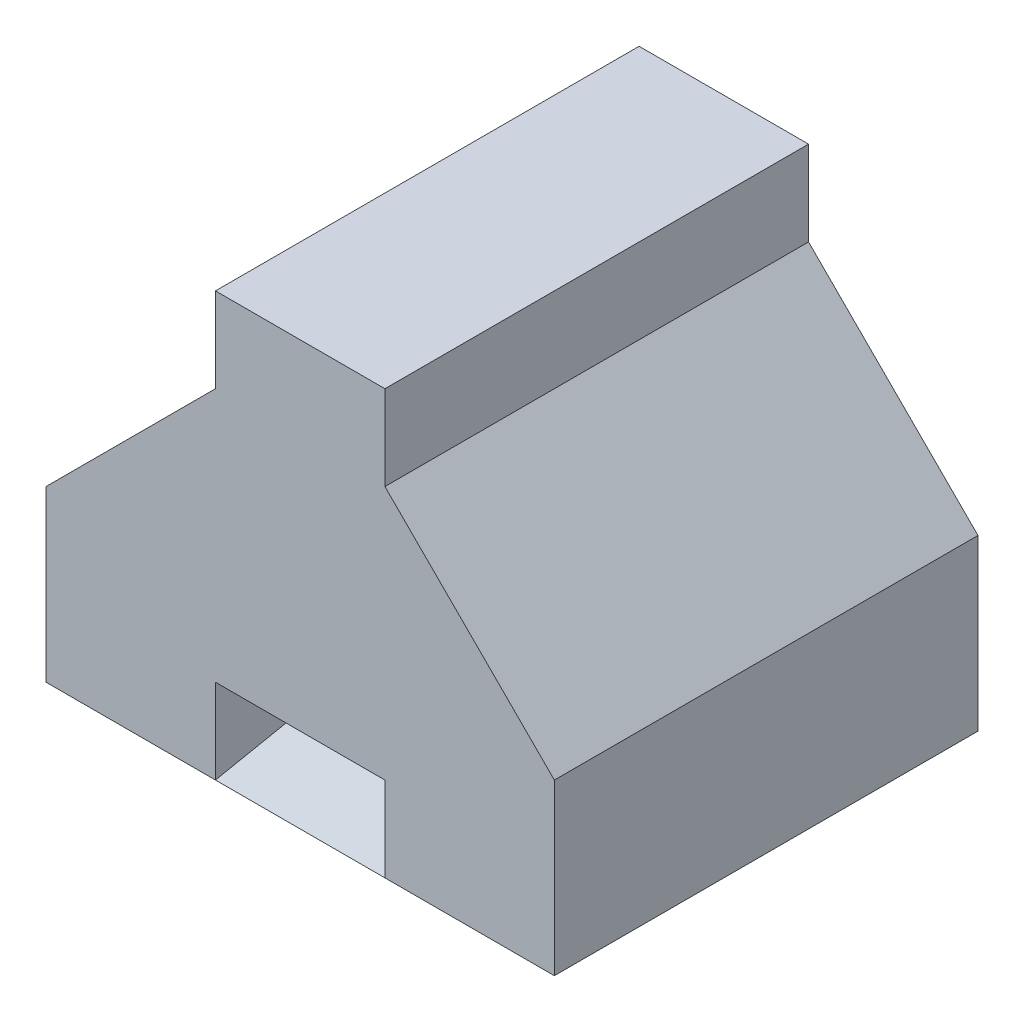
ISO-10303-21;
HEADER;
FILE_DESCRIPTION(('STEP AP214'),'2;1');
FILE_NAME('part.step','',(''),(''),'','','');
FILE_SCHEMA(('AUTOMOTIVE_DESIGN { 1 0 10303 214 1 1 1 1 }'));
ENDSEC;
DATA;
#1=APPLICATION_CONTEXT('core data for automotive mechanical design processes');
#2=APPLICATION_PROTOCOL_DEFINITION('international standard','automotive_design',2000,#1);
#3=PRODUCT_CONTEXT('',#1,'mechanical');
#4=PRODUCT('Part','Part','',(#3));
#5=PRODUCT_RELATED_PRODUCT_CATEGORY('part','',(#4));
#6=PRODUCT_DEFINITION_FORMATION('','',#4);
#7=PRODUCT_DEFINITION_CONTEXT('part definition',#1,'design');
#8=PRODUCT_DEFINITION('design','',#6,#7);
#9=PRODUCT_DEFINITION_SHAPE('','',#8);
#10=(LENGTH_UNIT() NAMED_UNIT(*) SI_UNIT(.MILLI.,.METRE.));
#11=(NAMED_UNIT(*) PLANE_ANGLE_UNIT() SI_UNIT($,.RADIAN.));
#12=(NAMED_UNIT(*) SI_UNIT($,.STERADIAN.) SOLID_ANGLE_UNIT());
#13=UNCERTAINTY_MEASURE_WITH_UNIT(LENGTH_MEASURE(1.E-05),#10,'distance_accuracy_value','');
#14=(GEOMETRIC_REPRESENTATION_CONTEXT(3) GLOBAL_UNCERTAINTY_ASSIGNED_CONTEXT((#13)) GLOBAL_UNIT_ASSIGNED_CONTEXT((#10,
#11,#12)) REPRESENTATION_CONTEXT('',''));
#15=CARTESIAN_POINT('',(0.,0.,0.));
#16=DIRECTION('',(0.,0.,1.));
#17=DIRECTION('',(1.,0.,0.));
#18=AXIS2_PLACEMENT_3D('',#15,#16,#17);
#19=CARTESIAN_POINT('',(-10.,0.,0.));
#20=DIRECTION('',(0.,1.,0.));
#21=DIRECTION('',(0.,0.,1.));
#22=AXIS2_PLACEMENT_3D('',#19,#20,#21);
#23=PLANE('',#22);
#24=DIRECTION('',(0.,0.,-1.));
#25=VECTOR('',#24,1.);
#26=CARTESIAN_POINT('',(-20.,0.,0.));
#27=LINE('',#26,#25);
#28=CARTESIAN_POINT('',(-20.,0.,25.));
#29=VERTEX_POINT('',#28);
#30=CARTESIAN_POINT('',(-20.,0.,0.));
#31=VERTEX_POINT('',#30);
#32=EDGE_CURVE('E90',#29,#31,#27,.T.);
#33=ORIENTED_EDGE('',*,*,#32,.T.);
#34=DIRECTION('',(-1.,0.,0.));
#35=VECTOR('',#34,1.);
#36=CARTESIAN_POINT('',(-10.,0.,0.));
#37=LINE('',#36,#35);
#38=CARTESIAN_POINT('',(-10.,0.,0.));
#39=VERTEX_POINT('',#38);
#40=EDGE_CURVE('E12',#39,#31,#37,.T.);
#41=ORIENTED_EDGE('',*,*,#40,.F.);
#42=DIRECTION('',(0.,0.,-1.));
#43=VECTOR('',#42,1.);
#44=CARTESIAN_POINT('',(-10.,0.,0.));
#45=LINE('',#44,#43);
#46=CARTESIAN_POINT('',(-10.,0.,25.));
#47=VERTEX_POINT('',#46);
#48=EDGE_CURVE('E83',#47,#39,#45,.T.);
#49=ORIENTED_EDGE('',*,*,#48,.F.);
#50=DIRECTION('',(-1.,0.,0.));
#51=VECTOR('',#50,1.);
#52=CARTESIAN_POINT('',(-10.,0.,25.));
#53=LINE('',#52,#51);
#54=EDGE_CURVE('E91',#47,#29,#53,.T.);
#55=ORIENTED_EDGE('',*,*,#54,.T.);
#56=EDGE_LOOP('',(#33,#41,#49,#55));
#57=FACE_BOUND('',#56,.T.);
#58=ADVANCED_FACE('F43',(#57),#23,.F.);
#59=CARTESIAN_POINT('',(-10.,5.,0.));
#60=DIRECTION('',(0.,0.,1.));
#61=DIRECTION('',(1.,0.,0.));
#62=AXIS2_PLACEMENT_3D('',#59,#60,#61);
#63=PLANE('',#62);
#64=DIRECTION('',(0.,1.,0.));
#65=VECTOR('',#64,1.);
#66=CARTESIAN_POINT('',(-20.,5.,0.));
#67=LINE('',#66,#65);
#68=CARTESIAN_POINT('',(-20.,5.,0.));
#69=VERTEX_POINT('',#68);
#70=EDGE_CURVE('E71',#31,#69,#67,.T.);
#71=ORIENTED_EDGE('',*,*,#70,.T.);
#72=DIRECTION('',(-1.,0.,0.));
#73=VECTOR('',#72,1.);
#74=CARTESIAN_POINT('',(-10.,5.,0.));
#75=LINE('',#74,#73);
#76=CARTESIAN_POINT('',(-10.,5.,0.));
#77=VERTEX_POINT('',#76);
#78=EDGE_CURVE('E51',#77,#69,#75,.T.);
#79=ORIENTED_EDGE('',*,*,#78,.F.);
#80=DIRECTION('',(0.,1.,0.));
#81=VECTOR('',#80,1.);
#82=CARTESIAN_POINT('',(-10.,5.,0.));
#83=LINE('',#82,#81);
#84=EDGE_CURVE('E79',#39,#77,#83,.T.);
#85=ORIENTED_EDGE('',*,*,#84,.F.);
#86=ORIENTED_EDGE('',*,*,#40,.T.);
#87=EDGE_LOOP('',(#71,#79,#85,#86));
#88=FACE_BOUND('',#87,.T.);
#89=ADVANCED_FACE('F80',(#88),#63,.F.);
#90=CARTESIAN_POINT('',(-10.,0.,25.));
#91=DIRECTION('',(0.,-0.98058067569092,-0.196116135138184));
#92=DIRECTION('',(0.,0.196116135138184,-0.98058067569092));
#93=AXIS2_PLACEMENT_3D('',#90,#91,#92);
#94=PLANE('',#93);
#95=DIRECTION('',(0.,-0.196116135138184,0.98058067569092));
#96=VECTOR('',#95,1.);
#97=CARTESIAN_POINT('',(-20.,0.,25.));
#98=LINE('',#97,#96);
#99=EDGE_CURVE('E76',#69,#29,#98,.T.);
#100=ORIENTED_EDGE('',*,*,#99,.T.);
#101=ORIENTED_EDGE('',*,*,#54,.F.);
#102=DIRECTION('',(0.,-0.196116135138184,0.98058067569092));
#103=VECTOR('',#102,1.);
#104=CARTESIAN_POINT('',(-10.,0.,25.));
#105=LINE('',#104,#103);
#106=EDGE_CURVE('E59',#77,#47,#105,.T.);
#107=ORIENTED_EDGE('',*,*,#106,.F.);
#108=ORIENTED_EDGE('',*,*,#78,.T.);
#109=EDGE_LOOP('',(#100,#101,#107,#108));
#110=FACE_BOUND('',#109,.T.);
#111=ADVANCED_FACE('F98',(#110),#94,.F.);
#112=CARTESIAN_POINT('',(-10.,0.,0.));
#113=DIRECTION('',(1.,0.,0.));
#114=DIRECTION('',(0.,0.,-1.));
#115=AXIS2_PLACEMENT_3D('',#112,#113,#114);
#116=PLANE('',#115);
#117=ORIENTED_EDGE('',*,*,#48,.T.);
#118=ORIENTED_EDGE('',*,*,#84,.T.);
#119=ORIENTED_EDGE('',*,*,#106,.T.);
#120=EDGE_LOOP('',(#117,#118,#119));
#121=FACE_BOUND('',#120,.T.);
#122=ADVANCED_FACE('F86',(#121),#116,.T.);
#123=CARTESIAN_POINT('',(-20.,0.,0.));
#124=DIRECTION('',(1.,0.,0.));
#125=DIRECTION('',(0.,0.,-1.));
#126=AXIS2_PLACEMENT_3D('',#123,#124,#125);
#127=PLANE('',#126);
#128=ORIENTED_EDGE('',*,*,#32,.F.);
#129=ORIENTED_EDGE('',*,*,#99,.F.);
#130=ORIENTED_EDGE('',*,*,#70,.F.);
#131=EDGE_LOOP('',(#128,#129,#130));
#132=FACE_BOUND('',#131,.T.);
#133=ADVANCED_FACE('F99',(#132),#127,.F.);
#134=CLOSED_SHELL('',(#58,#89,#111,#122,#133));
#135=MANIFOLD_SOLID_BREP('B2',#134);
#136=CARTESIAN_POINT('',(0.,0.,25.));
#137=DIRECTION('',(0.,1.,0.));
#138=DIRECTION('',(-1.,0.,0.));
#139=AXIS2_PLACEMENT_3D('',#136,#137,#138);
#140=PLANE('',#139);
#141=DIRECTION('',(1.,0.,0.));
#142=VECTOR('',#141,1.);
#143=CARTESIAN_POINT('',(0.,0.,0.));
#144=LINE('',#143,#142);
#145=CARTESIAN_POINT('',(-30.,0.,0.));
#146=VERTEX_POINT('',#145);
#147=CARTESIAN_POINT('',(-20.,0.,0.));
#148=VERTEX_POINT('',#147);
#149=EDGE_CURVE('E250',#146,#148,#144,.T.);
#150=ORIENTED_EDGE('',*,*,#149,.T.);
#151=DIRECTION('',(0.,0.,1.));
#152=VECTOR('',#151,1.);
#153=CARTESIAN_POINT('',(-20.,0.,-21.));
#154=LINE('',#153,#152);
#155=CARTESIAN_POINT('',(-20.,0.,25.));
#156=VERTEX_POINT('',#155);
#157=EDGE_CURVE('E338',#148,#156,#154,.T.);
#158=ORIENTED_EDGE('',*,*,#157,.T.);
#159=DIRECTION('',(1.,0.,0.));
#160=VECTOR('',#159,1.);
#161=CARTESIAN_POINT('',(0.,0.,25.));
#162=LINE('',#161,#160);
#163=CARTESIAN_POINT('',(-30.,0.,25.));
#164=VERTEX_POINT('',#163);
#165=EDGE_CURVE('E315',#164,#156,#162,.T.);
#166=ORIENTED_EDGE('',*,*,#165,.F.);
#167=DIRECTION('',(0.,0.,-1.));
#168=VECTOR('',#167,1.);
#169=CARTESIAN_POINT('',(-30.,0.,25.));
#170=LINE('',#169,#168);
#171=EDGE_CURVE('E246',#164,#146,#170,.T.);
#172=ORIENTED_EDGE('',*,*,#171,.T.);
#173=EDGE_LOOP('',(#150,#158,#166,#172));
#174=FACE_BOUND('',#173,.T.);
#175=ADVANCED_FACE('F141',(#174),#140,.F.);
#176=CARTESIAN_POINT('',(-10.,0.,25.));
#177=VERTEX_POINT('',#176);
#178=CARTESIAN_POINT('',(0.,0.,25.));
#179=VERTEX_POINT('',#178);
#180=EDGE_CURVE('E206',#177,#179,#162,.T.);
#181=ORIENTED_EDGE('',*,*,#180,.F.);
#182=DIRECTION('',(0.,0.,1.));
#183=VECTOR('',#182,1.);
#184=CARTESIAN_POINT('',(-10.,0.,-21.));
#185=LINE('',#184,#183);
#186=CARTESIAN_POINT('',(-10.,0.,0.));
#187=VERTEX_POINT('',#186);
#188=EDGE_CURVE('E302',#187,#177,#185,.T.);
#189=ORIENTED_EDGE('',*,*,#188,.F.);
#190=CARTESIAN_POINT('',(0.,0.,0.));
#191=VERTEX_POINT('',#190);
#192=EDGE_CURVE('E254',#187,#191,#144,.T.);
#193=ORIENTED_EDGE('',*,*,#192,.T.);
#194=DIRECTION('',(0.,0.,-1.));
#195=VECTOR('',#194,1.);
#196=CARTESIAN_POINT('',(0.,0.,25.));
#197=LINE('',#196,#195);
#198=EDGE_CURVE('E278',#179,#191,#197,.T.);
#199=ORIENTED_EDGE('',*,*,#198,.F.);
#200=EDGE_LOOP('',(#181,#189,#193,#199));
#201=FACE_BOUND('',#200,.T.);
#202=ADVANCED_FACE('F143',(#201),#140,.F.);
#203=CARTESIAN_POINT('',(0.,10.,25.));
#204=DIRECTION('',(-1.,0.,0.));
#205=DIRECTION('',(0.,0.,1.));
#206=AXIS2_PLACEMENT_3D('',#203,#204,#205);
#207=PLANE('',#206);
#208=DIRECTION('',(0.,1.,0.));
#209=VECTOR('',#208,1.);
#210=CARTESIAN_POINT('',(0.,10.,0.));
#211=LINE('',#210,#209);
#212=CARTESIAN_POINT('',(0.,10.,0.));
#213=VERTEX_POINT('',#212);
#214=EDGE_CURVE('E253',#191,#213,#211,.T.);
#215=ORIENTED_EDGE('',*,*,#214,.T.);
#216=DIRECTION('',(0.,0.,-1.));
#217=VECTOR('',#216,1.);
#218=CARTESIAN_POINT('',(0.,10.,25.));
#219=LINE('',#218,#217);
#220=CARTESIAN_POINT('',(0.,10.,25.));
#221=VERTEX_POINT('',#220);
#222=EDGE_CURVE('E275',#221,#213,#219,.T.);
#223=ORIENTED_EDGE('',*,*,#222,.F.);
#224=DIRECTION('',(0.,1.,0.));
#225=VECTOR('',#224,1.);
#226=CARTESIAN_POINT('',(0.,10.,25.));
#227=LINE('',#226,#225);
#228=EDGE_CURVE('E317',#179,#221,#227,.T.);
#229=ORIENTED_EDGE('',*,*,#228,.F.);
#230=ORIENTED_EDGE('',*,*,#198,.T.);
#231=EDGE_LOOP('',(#215,#223,#229,#230));
#232=FACE_BOUND('',#231,.T.);
#233=ADVANCED_FACE('F364',(#232),#207,.F.);
#234=CARTESIAN_POINT('',(-9.99999999999999,20.,25.));
#235=DIRECTION('',(-0.707106781186548,-0.707106781186547,0.));
#236=DIRECTION('',(0.707106781186547,-0.707106781186548,0.));
#237=AXIS2_PLACEMENT_3D('',#234,#235,#236);
#238=PLANE('',#237);
#239=DIRECTION('',(-0.707106781186547,0.707106781186548,0.));
#240=VECTOR('',#239,1.);
#241=CARTESIAN_POINT('',(-9.99999999999999,20.,0.));
#242=LINE('',#241,#240);
#243=CARTESIAN_POINT('',(-9.99999999999999,20.,0.));
#244=VERTEX_POINT('',#243);
#245=EDGE_CURVE('E256',#213,#244,#242,.T.);
#246=ORIENTED_EDGE('',*,*,#245,.T.);
#247=DIRECTION('',(0.,0.,-1.));
#248=VECTOR('',#247,1.);
#249=CARTESIAN_POINT('',(-9.99999999999999,20.,25.));
#250=LINE('',#249,#248);
#251=CARTESIAN_POINT('',(-9.99999999999999,20.,25.));
#252=VERTEX_POINT('',#251);
#253=EDGE_CURVE('E272',#252,#244,#250,.T.);
#254=ORIENTED_EDGE('',*,*,#253,.F.);
#255=DIRECTION('',(-0.707106781186547,0.707106781186548,0.));
#256=VECTOR('',#255,1.);
#257=CARTESIAN_POINT('',(-9.99999999999999,20.,25.));
#258=LINE('',#257,#256);
#259=EDGE_CURVE('E319',#221,#252,#258,.T.);
#260=ORIENTED_EDGE('',*,*,#259,.F.);
#261=ORIENTED_EDGE('',*,*,#222,.T.);
#262=EDGE_LOOP('',(#246,#254,#260,#261));
#263=FACE_BOUND('',#262,.T.);
#264=ADVANCED_FACE('F368',(#263),#238,.F.);
#265=CARTESIAN_POINT('',(-10.,25.,25.));
#266=DIRECTION('',(-1.,0.,0.));
#267=DIRECTION('',(0.,-1.,0.));
#268=AXIS2_PLACEMENT_3D('',#265,#266,#267);
#269=PLANE('',#268);
#270=DIRECTION('',(0.,1.,0.));
#271=VECTOR('',#270,1.);
#272=CARTESIAN_POINT('',(-10.,25.,0.));
#273=LINE('',#272,#271);
#274=CARTESIAN_POINT('',(-10.,25.,0.));
#275=VERTEX_POINT('',#274);
#276=EDGE_CURVE('E258',#244,#275,#273,.T.);
#277=ORIENTED_EDGE('',*,*,#276,.T.);
#278=DIRECTION('',(0.,0.,-1.));
#279=VECTOR('',#278,1.);
#280=CARTESIAN_POINT('',(-10.,25.,25.));
#281=LINE('',#280,#279);
#282=CARTESIAN_POINT('',(-10.,25.,25.));
#283=VERTEX_POINT('',#282);
#284=EDGE_CURVE('E269',#283,#275,#281,.T.);
#285=ORIENTED_EDGE('',*,*,#284,.F.);
#286=DIRECTION('',(0.,1.,0.));
#287=VECTOR('',#286,1.);
#288=CARTESIAN_POINT('',(-10.,25.,25.));
#289=LINE('',#288,#287);
#290=EDGE_CURVE('E321',#252,#283,#289,.T.);
#291=ORIENTED_EDGE('',*,*,#290,.F.);
#292=ORIENTED_EDGE('',*,*,#253,.T.);
#293=EDGE_LOOP('',(#277,#285,#291,#292));
#294=FACE_BOUND('',#293,.T.);
#295=ADVANCED_FACE('F327',(#294),#269,.F.);
#296=CARTESIAN_POINT('',(-20.,25.,25.));
#297=DIRECTION('',(0.,-1.,0.));
#298=DIRECTION('',(0.,0.,-1.));
#299=AXIS2_PLACEMENT_3D('',#296,#297,#298);
#300=PLANE('',#299);
#301=DIRECTION('',(-1.,0.,0.));
#302=VECTOR('',#301,1.);
#303=CARTESIAN_POINT('',(-20.,25.,0.));
#304=LINE('',#303,#302);
#305=CARTESIAN_POINT('',(-20.,25.,0.));
#306=VERTEX_POINT('',#305);
#307=EDGE_CURVE('E260',#275,#306,#304,.T.);
#308=ORIENTED_EDGE('',*,*,#307,.T.);
#309=DIRECTION('',(0.,0.,-1.));
#310=VECTOR('',#309,1.);
#311=CARTESIAN_POINT('',(-20.,25.,25.));
#312=LINE('',#311,#310);
#313=CARTESIAN_POINT('',(-20.,25.,25.));
#314=VERTEX_POINT('',#313);
#315=EDGE_CURVE('E241',#314,#306,#312,.T.);
#316=ORIENTED_EDGE('',*,*,#315,.F.);
#317=DIRECTION('',(-1.,0.,0.));
#318=VECTOR('',#317,1.);
#319=CARTESIAN_POINT('',(-20.,25.,25.));
#320=LINE('',#319,#318);
#321=EDGE_CURVE('E229',#283,#314,#320,.T.);
#322=ORIENTED_EDGE('',*,*,#321,.F.);
#323=ORIENTED_EDGE('',*,*,#284,.T.);
#324=EDGE_LOOP('',(#308,#316,#322,#323));
#325=FACE_BOUND('',#324,.T.);
#326=ADVANCED_FACE('F331',(#325),#300,.F.);
#327=CARTESIAN_POINT('',(-20.,20.,25.));
#328=DIRECTION('',(1.,0.,0.));
#329=DIRECTION('',(0.,0.,-1.));
#330=AXIS2_PLACEMENT_3D('',#327,#328,#329);
#331=PLANE('',#330);
#332=DIRECTION('',(0.,-1.,0.));
#333=VECTOR('',#332,1.);
#334=CARTESIAN_POINT('',(-20.,20.,0.));
#335=LINE('',#334,#333);
#336=CARTESIAN_POINT('',(-20.,20.,0.));
#337=VERTEX_POINT('',#336);
#338=EDGE_CURVE('E238',#306,#337,#335,.T.);
#339=ORIENTED_EDGE('',*,*,#338,.T.);
#340=DIRECTION('',(0.,0.,-1.));
#341=VECTOR('',#340,1.);
#342=CARTESIAN_POINT('',(-20.,20.,25.));
#343=LINE('',#342,#341);
#344=CARTESIAN_POINT('',(-20.,20.,25.));
#345=VERTEX_POINT('',#344);
#346=EDGE_CURVE('E235',#345,#337,#343,.T.);
#347=ORIENTED_EDGE('',*,*,#346,.F.);
#348=DIRECTION('',(0.,-1.,0.));
#349=VECTOR('',#348,1.);
#350=CARTESIAN_POINT('',(-20.,20.,25.));
#351=LINE('',#350,#349);
#352=EDGE_CURVE('E222',#314,#345,#351,.T.);
#353=ORIENTED_EDGE('',*,*,#352,.F.);
#354=ORIENTED_EDGE('',*,*,#315,.T.);
#355=EDGE_LOOP('',(#339,#347,#353,#354));
#356=FACE_BOUND('',#355,.T.);
#357=ADVANCED_FACE('F236',(#356),#331,.F.);
#358=CARTESIAN_POINT('',(-30.,10.,25.));
#359=DIRECTION('',(0.707106781186547,-0.707106781186548,0.));
#360=DIRECTION('',(0.707106781186548,0.707106781186547,0.));
#361=AXIS2_PLACEMENT_3D('',#358,#359,#360);
#362=PLANE('',#361);
#363=DIRECTION('',(-0.707106781186548,-0.707106781186547,0.));
#364=VECTOR('',#363,1.);
#365=CARTESIAN_POINT('',(-30.,10.,0.));
#366=LINE('',#365,#364);
#367=CARTESIAN_POINT('',(-30.,10.,0.));
#368=VERTEX_POINT('',#367);
#369=EDGE_CURVE('E263',#337,#368,#366,.T.);
#370=ORIENTED_EDGE('',*,*,#369,.T.);
#371=DIRECTION('',(0.,0.,-1.));
#372=VECTOR('',#371,1.);
#373=CARTESIAN_POINT('',(-30.,10.,25.));
#374=LINE('',#373,#372);
#375=CARTESIAN_POINT('',(-30.,10.,25.));
#376=VERTEX_POINT('',#375);
#377=EDGE_CURVE('E242',#376,#368,#374,.T.);
#378=ORIENTED_EDGE('',*,*,#377,.F.);
#379=DIRECTION('',(-0.707106781186548,-0.707106781186547,0.));
#380=VECTOR('',#379,1.);
#381=CARTESIAN_POINT('',(-30.,10.,25.));
#382=LINE('',#381,#380);
#383=EDGE_CURVE('E226',#345,#376,#382,.T.);
#384=ORIENTED_EDGE('',*,*,#383,.F.);
#385=ORIENTED_EDGE('',*,*,#346,.T.);
#386=EDGE_LOOP('',(#370,#378,#384,#385));
#387=FACE_BOUND('',#386,.T.);
#388=ADVANCED_FACE('F244',(#387),#362,.F.);
#389=CARTESIAN_POINT('',(-30.,0.,25.));
#390=DIRECTION('',(1.,0.,0.));
#391=DIRECTION('',(0.,0.,-1.));
#392=AXIS2_PLACEMENT_3D('',#389,#390,#391);
#393=PLANE('',#392);
#394=DIRECTION('',(0.,-1.,0.));
#395=VECTOR('',#394,1.);
#396=CARTESIAN_POINT('',(-30.,0.,0.));
#397=LINE('',#396,#395);
#398=EDGE_CURVE('E198',#368,#146,#397,.T.);
#399=ORIENTED_EDGE('',*,*,#398,.T.);
#400=ORIENTED_EDGE('',*,*,#171,.F.);
#401=DIRECTION('',(0.,-1.,0.));
#402=VECTOR('',#401,1.);
#403=CARTESIAN_POINT('',(-30.,0.,25.));
#404=LINE('',#403,#402);
#405=EDGE_CURVE('E165',#376,#164,#404,.T.);
#406=ORIENTED_EDGE('',*,*,#405,.F.);
#407=ORIENTED_EDGE('',*,*,#377,.T.);
#408=EDGE_LOOP('',(#399,#400,#406,#407));
#409=FACE_BOUND('',#408,.T.);
#410=ADVANCED_FACE('F333',(#409),#393,.F.);
#411=CARTESIAN_POINT('',(0.,0.,25.));
#412=DIRECTION('',(0.,0.,-1.));
#413=DIRECTION('',(-1.,0.,0.));
#414=AXIS2_PLACEMENT_3D('',#411,#412,#413);
#415=PLANE('',#414);
#416=ORIENTED_EDGE('',*,*,#165,.T.);
#417=DIRECTION('',(0.,-1.,0.));
#418=VECTOR('',#417,1.);
#419=CARTESIAN_POINT('',(-20.,0.,25.));
#420=LINE('',#419,#418);
#421=CARTESIAN_POINT('',(-20.,5.,25.));
#422=VERTEX_POINT('',#421);
#423=EDGE_CURVE('E307',#422,#156,#420,.T.);
#424=ORIENTED_EDGE('',*,*,#423,.F.);
#425=DIRECTION('',(-1.,0.,0.));
#426=VECTOR('',#425,1.);
#427=CARTESIAN_POINT('',(-20.,5.,25.));
#428=LINE('',#427,#426);
#429=CARTESIAN_POINT('',(-10.,5.,25.));
#430=VERTEX_POINT('',#429);
#431=EDGE_CURVE('E311',#430,#422,#428,.T.);
#432=ORIENTED_EDGE('',*,*,#431,.F.);
#433=DIRECTION('',(0.,1.,0.));
#434=VECTOR('',#433,1.);
#435=CARTESIAN_POINT('',(-10.,5.,25.));
#436=LINE('',#435,#434);
#437=EDGE_CURVE('E350',#177,#430,#436,.T.);
#438=ORIENTED_EDGE('',*,*,#437,.F.);
#439=ORIENTED_EDGE('',*,*,#180,.T.);
#440=ORIENTED_EDGE('',*,*,#228,.T.);
#441=ORIENTED_EDGE('',*,*,#259,.T.);
#442=ORIENTED_EDGE('',*,*,#290,.T.);
#443=ORIENTED_EDGE('',*,*,#321,.T.);
#444=ORIENTED_EDGE('',*,*,#352,.T.);
#445=ORIENTED_EDGE('',*,*,#383,.T.);
#446=ORIENTED_EDGE('',*,*,#405,.T.);
#447=EDGE_LOOP('',(#416,#424,#432,#438,#439,#440,#441,#442,#443,#444,#445,#446));
#448=FACE_BOUND('',#447,.T.);
#449=ADVANCED_FACE('F224',(#448),#415,.F.);
#450=CARTESIAN_POINT('',(0.,0.,0.));
#451=DIRECTION('',(0.,0.,-1.));
#452=DIRECTION('',(-1.,0.,0.));
#453=AXIS2_PLACEMENT_3D('',#450,#451,#452);
#454=PLANE('',#453);
#455=DIRECTION('',(0.,1.,0.));
#456=VECTOR('',#455,1.);
#457=CARTESIAN_POINT('',(-20.,0.,0.));
#458=LINE('',#457,#456);
#459=CARTESIAN_POINT('',(-20.,5.,0.));
#460=VERTEX_POINT('',#459);
#461=EDGE_CURVE('E41',#148,#460,#458,.T.);
#462=ORIENTED_EDGE('',*,*,#461,.F.);
#463=ORIENTED_EDGE('',*,*,#149,.F.);
#464=ORIENTED_EDGE('',*,*,#398,.F.);
#465=ORIENTED_EDGE('',*,*,#369,.F.);
#466=ORIENTED_EDGE('',*,*,#338,.F.);
#467=ORIENTED_EDGE('',*,*,#307,.F.);
#468=ORIENTED_EDGE('',*,*,#276,.F.);
#469=ORIENTED_EDGE('',*,*,#245,.F.);
#470=ORIENTED_EDGE('',*,*,#214,.F.);
#471=ORIENTED_EDGE('',*,*,#192,.F.);
#472=DIRECTION('',(0.,-1.,0.));
#473=VECTOR('',#472,1.);
#474=CARTESIAN_POINT('',(-10.,0.,0.));
#475=LINE('',#474,#473);
#476=CARTESIAN_POINT('',(-10.,5.,0.));
#477=VERTEX_POINT('',#476);
#478=EDGE_CURVE('E281',#477,#187,#475,.T.);
#479=ORIENTED_EDGE('',*,*,#478,.F.);
#480=DIRECTION('',(1.,0.,0.));
#481=VECTOR('',#480,1.);
#482=CARTESIAN_POINT('',(0.,5.,0.));
#483=LINE('',#482,#481);
#484=EDGE_CURVE('E149',#460,#477,#483,.T.);
#485=ORIENTED_EDGE('',*,*,#484,.F.);
#486=EDGE_LOOP('',(#462,#463,#464,#465,#466,#467,#468,#469,#470,#471,#479,#485));
#487=FACE_BOUND('',#486,.T.);
#488=ADVANCED_FACE('F295',(#487),#454,.T.);
#489=CARTESIAN_POINT('',(-20.,0.,-21.));
#490=DIRECTION('',(-1.,0.,0.));
#491=DIRECTION('',(0.,0.,1.));
#492=AXIS2_PLACEMENT_3D('',#489,#490,#491);
#493=PLANE('',#492);
#494=ORIENTED_EDGE('',*,*,#461,.T.);
#495=DIRECTION('',(0.,0.,1.));
#496=VECTOR('',#495,1.);
#497=CARTESIAN_POINT('',(-20.,5.,-21.));
#498=LINE('',#497,#496);
#499=EDGE_CURVE('E291',#460,#422,#498,.T.);
#500=ORIENTED_EDGE('',*,*,#499,.T.);
#501=ORIENTED_EDGE('',*,*,#423,.T.);
#502=ORIENTED_EDGE('',*,*,#157,.F.);
#503=EDGE_LOOP('',(#494,#500,#501,#502));
#504=FACE_BOUND('',#503,.T.);
#505=ADVANCED_FACE('F346',(#504),#493,.F.);
#506=CARTESIAN_POINT('',(-20.,5.,-21.));
#507=DIRECTION('',(0.,1.,0.));
#508=DIRECTION('',(0.,0.,1.));
#509=AXIS2_PLACEMENT_3D('',#506,#507,#508);
#510=PLANE('',#509);
#511=ORIENTED_EDGE('',*,*,#484,.T.);
#512=DIRECTION('',(0.,0.,1.));
#513=VECTOR('',#512,1.);
#514=CARTESIAN_POINT('',(-10.,5.,-21.));
#515=LINE('',#514,#513);
#516=EDGE_CURVE('E156',#477,#430,#515,.T.);
#517=ORIENTED_EDGE('',*,*,#516,.T.);
#518=ORIENTED_EDGE('',*,*,#431,.T.);
#519=ORIENTED_EDGE('',*,*,#499,.F.);
#520=EDGE_LOOP('',(#511,#517,#518,#519));
#521=FACE_BOUND('',#520,.T.);
#522=ADVANCED_FACE('F286',(#521),#510,.F.);
#523=CARTESIAN_POINT('',(-10.,5.,-21.));
#524=DIRECTION('',(1.,0.,0.));
#525=DIRECTION('',(0.,0.,-1.));
#526=AXIS2_PLACEMENT_3D('',#523,#524,#525);
#527=PLANE('',#526);
#528=ORIENTED_EDGE('',*,*,#478,.T.);
#529=ORIENTED_EDGE('',*,*,#188,.T.);
#530=ORIENTED_EDGE('',*,*,#437,.T.);
#531=ORIENTED_EDGE('',*,*,#516,.F.);
#532=EDGE_LOOP('',(#528,#529,#530,#531));
#533=FACE_BOUND('',#532,.T.);
#534=ADVANCED_FACE('F300',(#533),#527,.F.);
#535=CLOSED_SHELL('',(#175,#202,#233,#264,#295,#326,#357,#388,#410,#449,#488,#505,#522,#534));
#536=MANIFOLD_SOLID_BREP('B6',#535);
#537=ADVANCED_BREP_SHAPE_REPRESENTATION('',(#18,#135,#536),#14);
#538=SHAPE_DEFINITION_REPRESENTATION(#9,#537);
ENDSEC;
END-ISO-10303-21;
